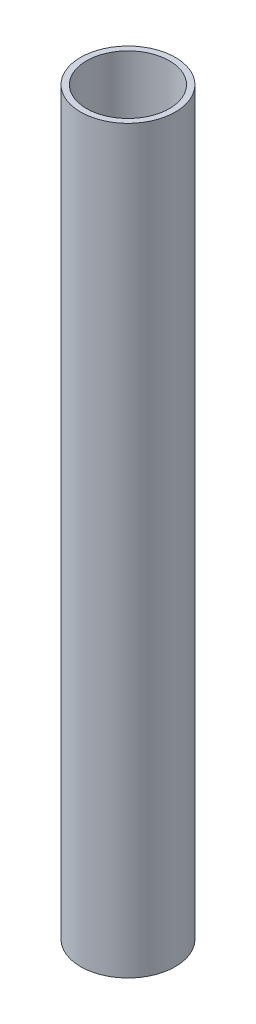
ISO-10303-21;
HEADER;
FILE_DESCRIPTION(('STEP AP214'),'2;1');
FILE_NAME('part.step','',(''),(''),'','','');
FILE_SCHEMA(('AUTOMOTIVE_DESIGN { 1 0 10303 214 1 1 1 1 }'));
ENDSEC;
DATA;
#1=APPLICATION_CONTEXT('core data for automotive mechanical design processes');
#2=APPLICATION_PROTOCOL_DEFINITION('international standard','automotive_design',2000,#1);
#3=PRODUCT_CONTEXT('',#1,'mechanical');
#4=PRODUCT('Part','Part','',(#3));
#5=PRODUCT_RELATED_PRODUCT_CATEGORY('part','',(#4));
#6=PRODUCT_DEFINITION_FORMATION('','',#4);
#7=PRODUCT_DEFINITION_CONTEXT('part definition',#1,'design');
#8=PRODUCT_DEFINITION('design','',#6,#7);
#9=PRODUCT_DEFINITION_SHAPE('','',#8);
#10=(LENGTH_UNIT() NAMED_UNIT(*) SI_UNIT(.MILLI.,.METRE.));
#11=(NAMED_UNIT(*) PLANE_ANGLE_UNIT() SI_UNIT($,.RADIAN.));
#12=(NAMED_UNIT(*) SI_UNIT($,.STERADIAN.) SOLID_ANGLE_UNIT());
#13=UNCERTAINTY_MEASURE_WITH_UNIT(LENGTH_MEASURE(1.E-05),#10,'distance_accuracy_value','');
#14=(GEOMETRIC_REPRESENTATION_CONTEXT(3) GLOBAL_UNCERTAINTY_ASSIGNED_CONTEXT((#13)) GLOBAL_UNIT_ASSIGNED_CONTEXT((#10,
#11,#12)) REPRESENTATION_CONTEXT('',''));
#15=CARTESIAN_POINT('',(0.,0.,0.));
#16=DIRECTION('',(0.,0.,1.));
#17=DIRECTION('',(1.,0.,0.));
#18=AXIS2_PLACEMENT_3D('',#15,#16,#17);
#19=CARTESIAN_POINT('',(0.,125.,0.));
#20=DIRECTION('',(0.,1.,0.));
#21=DIRECTION('',(0.,0.,1.));
#22=AXIS2_PLACEMENT_3D('',#19,#20,#21);
#23=PLANE('',#22);
#24=CARTESIAN_POINT('',(0.,125.,0.));
#25=DIRECTION('',(0.,1.,0.));
#26=DIRECTION('',(0.,0.,1.));
#27=AXIS2_PLACEMENT_3D('',#24,#25,#26);
#28=CIRCLE('',#27,8.);
#29=CARTESIAN_POINT('',(0.,125.,8.));
#30=VERTEX_POINT('',#29);
#31=EDGE_CURVE('E10',#30,#30,#28,.T.);
#32=ORIENTED_EDGE('',*,*,#31,.T.);
#33=EDGE_LOOP('',(#32));
#34=FACE_BOUND('',#33,.T.);
#35=CARTESIAN_POINT('',(0.,125.,0.));
#36=DIRECTION('',(0.,1.,0.));
#37=DIRECTION('',(0.,0.,1.));
#38=AXIS2_PLACEMENT_3D('',#35,#36,#37);
#39=CIRCLE('',#38,7.);
#40=CARTESIAN_POINT('',(0.,125.,7.));
#41=VERTEX_POINT('',#40);
#42=EDGE_CURVE('E47',#41,#41,#39,.T.);
#43=ORIENTED_EDGE('',*,*,#42,.F.);
#44=EDGE_LOOP('',(#43));
#45=FACE_BOUND('',#44,.T.);
#46=ADVANCED_FACE('F36',(#34,#45),#23,.T.);
#47=CARTESIAN_POINT('',(0.,0.,0.));
#48=DIRECTION('',(0.,1.,0.));
#49=DIRECTION('',(0.,0.,1.));
#50=AXIS2_PLACEMENT_3D('',#47,#48,#49);
#51=PLANE('',#50);
#52=CARTESIAN_POINT('',(0.,0.,0.));
#53=DIRECTION('',(0.,1.,0.));
#54=DIRECTION('',(0.,0.,1.));
#55=AXIS2_PLACEMENT_3D('',#52,#53,#54);
#56=CIRCLE('',#55,8.);
#57=CARTESIAN_POINT('',(0.,0.,8.));
#58=VERTEX_POINT('',#57);
#59=EDGE_CURVE('E40',#58,#58,#56,.T.);
#60=ORIENTED_EDGE('',*,*,#59,.F.);
#61=EDGE_LOOP('',(#60));
#62=FACE_BOUND('',#61,.T.);
#63=CARTESIAN_POINT('',(0.,0.,0.));
#64=DIRECTION('',(0.,1.,0.));
#65=DIRECTION('',(0.,0.,1.));
#66=AXIS2_PLACEMENT_3D('',#63,#64,#65);
#67=CIRCLE('',#66,7.);
#68=CARTESIAN_POINT('',(0.,0.,7.));
#69=VERTEX_POINT('',#68);
#70=EDGE_CURVE('E49',#69,#69,#67,.T.);
#71=ORIENTED_EDGE('',*,*,#70,.T.);
#72=EDGE_LOOP('',(#71));
#73=FACE_BOUND('',#72,.T.);
#74=ADVANCED_FACE('F59',(#62,#73),#51,.F.);
#75=CARTESIAN_POINT('',(0.,125.,0.));
#76=DIRECTION('',(0.,-1.,0.));
#77=DIRECTION('',(0.,0.,-1.));
#78=AXIS2_PLACEMENT_3D('',#75,#76,#77);
#79=CYLINDRICAL_SURFACE('',#78,8.);
#80=ORIENTED_EDGE('',*,*,#31,.F.);
#81=EDGE_LOOP('',(#80));
#82=FACE_BOUND('',#81,.T.);
#83=ORIENTED_EDGE('',*,*,#59,.T.);
#84=EDGE_LOOP('',(#83));
#85=FACE_BOUND('',#84,.T.);
#86=ADVANCED_FACE('F38',(#82,#85),#79,.T.);
#87=CARTESIAN_POINT('',(0.,125.,0.));
#88=DIRECTION('',(0.,-1.,0.));
#89=DIRECTION('',(0.,0.,-1.));
#90=AXIS2_PLACEMENT_3D('',#87,#88,#89);
#91=CYLINDRICAL_SURFACE('',#90,7.);
#92=ORIENTED_EDGE('',*,*,#42,.T.);
#93=EDGE_LOOP('',(#92));
#94=FACE_BOUND('',#93,.T.);
#95=ORIENTED_EDGE('',*,*,#70,.F.);
#96=EDGE_LOOP('',(#95));
#97=FACE_BOUND('',#96,.T.);
#98=ADVANCED_FACE('F55',(#94,#97),#91,.F.);
#99=CLOSED_SHELL('',(#46,#74,#86,#98));
#100=MANIFOLD_SOLID_BREP('B2',#99);
#101=ADVANCED_BREP_SHAPE_REPRESENTATION('',(#18,#100),#14);
#102=SHAPE_DEFINITION_REPRESENTATION(#9,#101);
ENDSEC;
END-ISO-10303-21;
